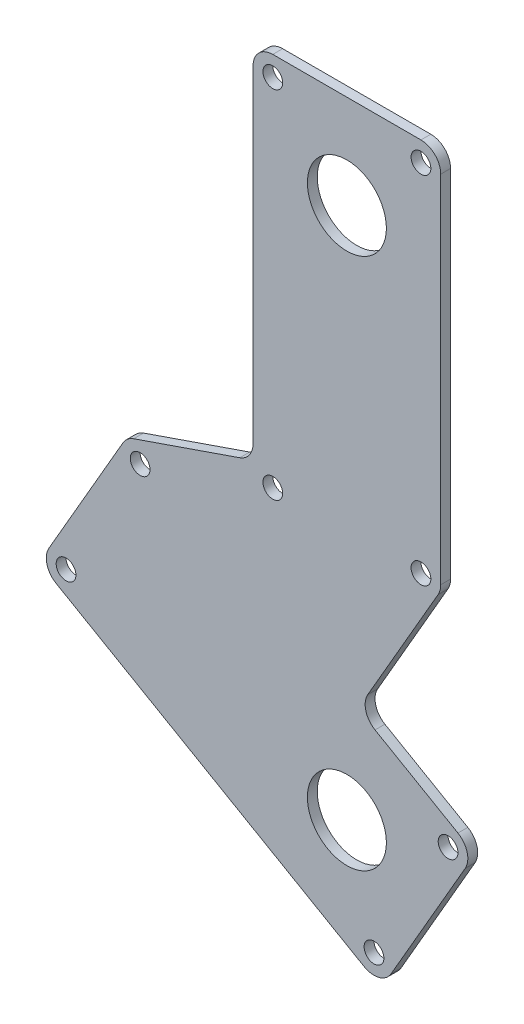
ISO-10303-21;
HEADER;
FILE_DESCRIPTION(('STEP AP214'),'2;1');
FILE_NAME('part.step','',(''),(''),'','','');
FILE_SCHEMA(('AUTOMOTIVE_DESIGN { 1 0 10303 214 1 1 1 1 }'));
ENDSEC;
DATA;
#1=APPLICATION_CONTEXT('core data for automotive mechanical design processes');
#2=APPLICATION_PROTOCOL_DEFINITION('international standard','automotive_design',2000,#1);
#3=PRODUCT_CONTEXT('',#1,'mechanical');
#4=PRODUCT('Part','Part','',(#3));
#5=PRODUCT_RELATED_PRODUCT_CATEGORY('part','',(#4));
#6=PRODUCT_DEFINITION_FORMATION('','',#4);
#7=PRODUCT_DEFINITION_CONTEXT('part definition',#1,'design');
#8=PRODUCT_DEFINITION('design','',#6,#7);
#9=PRODUCT_DEFINITION_SHAPE('','',#8);
#10=(LENGTH_UNIT() NAMED_UNIT(*) SI_UNIT(.MILLI.,.METRE.));
#11=(NAMED_UNIT(*) PLANE_ANGLE_UNIT() SI_UNIT($,.RADIAN.));
#12=(NAMED_UNIT(*) SI_UNIT($,.STERADIAN.) SOLID_ANGLE_UNIT());
#13=UNCERTAINTY_MEASURE_WITH_UNIT(LENGTH_MEASURE(1.E-05),#10,'distance_accuracy_value','');
#14=(GEOMETRIC_REPRESENTATION_CONTEXT(3) GLOBAL_UNCERTAINTY_ASSIGNED_CONTEXT((#13)) GLOBAL_UNIT_ASSIGNED_CONTEXT((#10,
#11,#12)) REPRESENTATION_CONTEXT('',''));
#15=CARTESIAN_POINT('',(0.,0.,0.));
#16=DIRECTION('',(0.,0.,1.));
#17=DIRECTION('',(1.,0.,0.));
#18=AXIS2_PLACEMENT_3D('',#15,#16,#17);
#19=CARTESIAN_POINT('',(-7.63092551338935,4.40571689932132,1.));
#20=DIRECTION('',(-0.866025403784438,0.5,0.));
#21=DIRECTION('',(-0.5,-0.866025403784438,0.));
#22=AXIS2_PLACEMENT_3D('',#19,#20,#21);
#23=PLANE('',#22);
#24=DIRECTION('',(0.5,0.866025403784438,0.));
#25=VECTOR('',#24,1.);
#26=CARTESIAN_POINT('',(-7.63092551338935,4.40571689932132,1.));
#27=LINE('',#26,#25);
#28=CARTESIAN_POINT('',(-30.1637748154254,-34.622322931098,1.));
#29=VERTEX_POINT('',#28);
#30=CARTESIAN_POINT('',(-22.6637748154254,-21.6319418743315,1.));
#31=VERTEX_POINT('',#30);
#32=EDGE_CURVE('E363',#29,#31,#27,.T.);
#33=ORIENTED_EDGE('',*,*,#32,.T.);
#34=DIRECTION('',(0.,0.,-1.));
#35=VECTOR('',#34,1.);
#36=CARTESIAN_POINT('',(-22.6637748154254,-21.6319418743315,0.));
#37=LINE('',#36,#35);
#38=CARTESIAN_POINT('',(-22.6637748154254,-21.6319418743315,0.));
#39=VERTEX_POINT('',#38);
#40=EDGE_CURVE('E229',#31,#39,#37,.T.);
#41=ORIENTED_EDGE('',*,*,#40,.T.);
#42=DIRECTION('',(0.5,0.866025403784438,0.));
#43=VECTOR('',#42,1.);
#44=CARTESIAN_POINT('',(-7.63092551338935,4.40571689932132,0.));
#45=LINE('',#44,#43);
#46=CARTESIAN_POINT('',(-30.1637748154254,-34.622322931098,0.));
#47=VERTEX_POINT('',#46);
#48=EDGE_CURVE('E337',#47,#39,#45,.T.);
#49=ORIENTED_EDGE('',*,*,#48,.F.);
#50=DIRECTION('',(0.,0.,-1.));
#51=VECTOR('',#50,1.);
#52=CARTESIAN_POINT('',(-30.1637748154254,-34.622322931098,1.));
#53=LINE('',#52,#51);
#54=EDGE_CURVE('E227',#47,#29,#53,.F.);
#55=ORIENTED_EDGE('',*,*,#54,.T.);
#56=EDGE_LOOP('',(#33,#41,#49,#55));
#57=FACE_BOUND('',#56,.T.);
#58=ADVANCED_FACE('F34',(#57),#23,.T.);
#59=CARTESIAN_POINT('',(-23.5328493020361,-40.7600906379882,1.));
#60=DIRECTION('',(-0.5,-0.866025403784439,0.));
#61=DIRECTION('',(0.866025403784439,-0.5,0.));
#62=AXIS2_PLACEMENT_3D('',#59,#60,#61);
#63=PLANE('',#62);
#64=DIRECTION('',(-0.866025403784439,0.5,0.));
#65=VECTOR('',#64,1.);
#66=CARTESIAN_POINT('',(-23.5328493020361,-40.7600906379882,1.));
#67=LINE('',#66,#65);
#68=CARTESIAN_POINT('',(1.74519052838324,-55.3543737386669,1.));
#69=VERTEX_POINT('',#68);
#70=CARTESIAN_POINT('',(-29.4317240078565,-37.3543737386669,1.));
#71=VERTEX_POINT('',#70);
#72=EDGE_CURVE('E356',#69,#71,#67,.T.);
#73=ORIENTED_EDGE('',*,*,#72,.T.);
#74=DIRECTION('',(0.,0.,-1.));
#75=VECTOR('',#74,1.);
#76=CARTESIAN_POINT('',(-29.4317240078565,-37.3543737386669,1.));
#77=LINE('',#76,#75);
#78=CARTESIAN_POINT('',(-29.4317240078565,-37.3543737386669,0.));
#79=VERTEX_POINT('',#78);
#80=EDGE_CURVE('E237',#71,#79,#77,.T.);
#81=ORIENTED_EDGE('',*,*,#80,.T.);
#82=DIRECTION('',(-0.866025403784439,0.5,0.));
#83=VECTOR('',#82,1.);
#84=CARTESIAN_POINT('',(-23.5328493020361,-40.7600906379882,0.));
#85=LINE('',#84,#83);
#86=CARTESIAN_POINT('',(1.74519052838324,-55.3543737386669,0.));
#87=VERTEX_POINT('',#86);
#88=EDGE_CURVE('E285',#87,#79,#85,.T.);
#89=ORIENTED_EDGE('',*,*,#88,.F.);
#90=DIRECTION('',(0.,0.,-1.));
#91=VECTOR('',#90,1.);
#92=CARTESIAN_POINT('',(1.74519052838324,-55.3543737386669,1.));
#93=LINE('',#92,#91);
#94=EDGE_CURVE('E235',#87,#69,#93,.F.);
#95=ORIENTED_EDGE('',*,*,#94,.T.);
#96=EDGE_LOOP('',(#73,#81,#89,#95));
#97=FACE_BOUND('',#96,.T.);
#98=ADVANCED_FACE('F345',(#97),#63,.T.);
#99=CARTESIAN_POINT('',(27.0100906379882,-15.5942831006787,1.));
#100=DIRECTION('',(0.866025403784439,-0.5,0.));
#101=DIRECTION('',(0.5,0.866025403784439,0.));
#102=AXIS2_PLACEMENT_3D('',#99,#100,#101);
#103=PLANE('',#102);
#104=DIRECTION('',(-0.5,-0.866025403784439,0.));
#105=VECTOR('',#104,1.);
#106=CARTESIAN_POINT('',(27.0100906379882,-15.5942831006787,1.));
#107=LINE('',#106,#105);
#108=CARTESIAN_POINT('',(11.9772413359521,-41.6319418743314,1.));
#109=VERTEX_POINT('',#108);
#110=CARTESIAN_POINT('',(4.47724133595212,-54.622322931098,1.));
#111=VERTEX_POINT('',#110);
#112=EDGE_CURVE('E354',#109,#111,#107,.T.);
#113=ORIENTED_EDGE('',*,*,#112,.T.);
#114=DIRECTION('',(0.,0.,-1.));
#115=VECTOR('',#114,1.);
#116=CARTESIAN_POINT('',(4.47724133595213,-54.622322931098,1.));
#117=LINE('',#116,#115);
#118=CARTESIAN_POINT('',(4.47724133595212,-54.622322931098,0.));
#119=VERTEX_POINT('',#118);
#120=EDGE_CURVE('E242',#111,#119,#117,.T.);
#121=ORIENTED_EDGE('',*,*,#120,.T.);
#122=DIRECTION('',(-0.5,-0.866025403784439,0.));
#123=VECTOR('',#122,1.);
#124=CARTESIAN_POINT('',(27.0100906379882,-15.5942831006787,0.));
#125=LINE('',#124,#123);
#126=CARTESIAN_POINT('',(11.9772413359521,-41.6319418743314,0.));
#127=VERTEX_POINT('',#126);
#128=EDGE_CURVE('E280',#127,#119,#125,.T.);
#129=ORIENTED_EDGE('',*,*,#128,.F.);
#130=DIRECTION('',(0.,0.,-1.));
#131=VECTOR('',#130,1.);
#132=CARTESIAN_POINT('',(11.9772413359522,-41.6319418743314,1.));
#133=LINE('',#132,#131);
#134=EDGE_CURVE('E240',#127,#109,#133,.F.);
#135=ORIENTED_EDGE('',*,*,#134,.T.);
#136=EDGE_LOOP('',(#113,#121,#129,#135));
#137=FACE_BOUND('',#136,.T.);
#138=ADVANCED_FACE('F358',(#137),#103,.T.);
#139=CARTESIAN_POINT('',(-14.032849302036,-24.3056079660838,1.));
#140=DIRECTION('',(0.5,0.866025403784439,0.));
#141=DIRECTION('',(-0.866025403784439,0.5,0.));
#142=AXIS2_PLACEMENT_3D('',#139,#140,#141);
#143=PLANE('',#142);
#144=DIRECTION('',(0.866025403784439,-0.5,0.));
#145=VECTOR('',#144,1.);
#146=CARTESIAN_POINT('',(-14.032849302036,-24.3056079660838,1.));
#147=LINE('',#146,#145);
#148=CARTESIAN_POINT('',(2.85048094716168,-34.0532032302755,1.));
#149=VERTEX_POINT('',#148);
#150=CARTESIAN_POINT('',(11.2451905283833,-38.8998910667625,1.));
#151=VERTEX_POINT('',#150);
#152=EDGE_CURVE('E261',#149,#151,#147,.T.);
#153=ORIENTED_EDGE('',*,*,#152,.T.);
#154=DIRECTION('',(0.,0.,-1.));
#155=VECTOR('',#154,1.);
#156=CARTESIAN_POINT('',(11.2451905283833,-38.8998910667625,1.));
#157=LINE('',#156,#155);
#158=CARTESIAN_POINT('',(11.2451905283833,-38.8998910667625,0.));
#159=VERTEX_POINT('',#158);
#160=EDGE_CURVE('E247',#151,#159,#157,.T.);
#161=ORIENTED_EDGE('',*,*,#160,.T.);
#162=DIRECTION('',(0.866025403784439,-0.5,0.));
#163=VECTOR('',#162,1.);
#164=CARTESIAN_POINT('',(-14.032849302036,-24.3056079660838,0.));
#165=LINE('',#164,#163);
#166=CARTESIAN_POINT('',(2.85048094716168,-34.0532032302755,0.));
#167=VERTEX_POINT('',#166);
#168=EDGE_CURVE('E275',#167,#159,#165,.T.);
#169=ORIENTED_EDGE('',*,*,#168,.F.);
#170=DIRECTION('',(0.,0.,-1.));
#171=VECTOR('',#170,1.);
#172=CARTESIAN_POINT('',(2.85048094716168,-34.0532032302755,1.));
#173=LINE('',#172,#171);
#174=EDGE_CURVE('E245',#167,#149,#173,.F.);
#175=ORIENTED_EDGE('',*,*,#174,.T.);
#176=EDGE_LOOP('',(#153,#161,#169,#175));
#177=FACE_BOUND('',#176,.T.);
#178=ADVANCED_FACE('F278',(#177),#143,.T.);
#179=CARTESIAN_POINT('',(15.1512794416288,-8.74759526419165,1.));
#180=DIRECTION('',(0.866025403784439,-0.5,0.));
#181=DIRECTION('',(0.5,0.866025403784439,0.));
#182=AXIS2_PLACEMENT_3D('',#179,#180,#181);
#183=PLANE('',#182);
#184=DIRECTION('',(-0.5,-0.866025403784439,0.));
#185=VECTOR('',#184,1.);
#186=CARTESIAN_POINT('',(15.1512794416288,-8.74759526419165,0.));
#187=LINE('',#186,#185);
#188=CARTESIAN_POINT('',(9.23205080756887,-19.,0.));
#189=VERTEX_POINT('',#188);
#190=CARTESIAN_POINT('',(2.1184301395928,-31.3211524227066,0.));
#191=VERTEX_POINT('',#190);
#192=EDGE_CURVE('E276',#189,#191,#187,.T.);
#193=ORIENTED_EDGE('',*,*,#192,.F.);
#194=DIRECTION('',(0.,0.,-1.));
#195=VECTOR('',#194,1.);
#196=CARTESIAN_POINT('',(9.23205080756888,-19.,1.));
#197=LINE('',#196,#195);
#198=CARTESIAN_POINT('',(9.23205080756887,-19.,1.));
#199=VERTEX_POINT('',#198);
#200=EDGE_CURVE('E225',#189,#199,#197,.F.);
#201=ORIENTED_EDGE('',*,*,#200,.T.);
#202=DIRECTION('',(-0.5,-0.866025403784439,0.));
#203=VECTOR('',#202,1.);
#204=CARTESIAN_POINT('',(15.1512794416288,-8.74759526419165,1.));
#205=LINE('',#204,#203);
#206=CARTESIAN_POINT('',(2.1184301395928,-31.3211524227066,1.));
#207=VERTEX_POINT('',#206);
#208=EDGE_CURVE('E258',#199,#207,#205,.T.);
#209=ORIENTED_EDGE('',*,*,#208,.T.);
#210=DIRECTION('',(0.,0.,-1.));
#211=VECTOR('',#210,1.);
#212=CARTESIAN_POINT('',(2.1184301395928,-31.3211524227066,0.));
#213=LINE('',#212,#211);
#214=EDGE_CURVE('E222',#207,#191,#213,.T.);
#215=ORIENTED_EDGE('',*,*,#214,.T.);
#216=EDGE_LOOP('',(#193,#201,#209,#215));
#217=FACE_BOUND('',#216,.T.);
#218=ADVANCED_FACE('F267',(#217),#183,.T.);
#219=CARTESIAN_POINT('',(9.5,0.,1.));
#220=DIRECTION('',(-1.,0.,0.));
#221=DIRECTION('',(0.,0.,1.));
#222=AXIS2_PLACEMENT_3D('',#219,#220,#221);
#223=PLANE('',#222);
#224=DIRECTION('',(0.,1.,0.));
#225=VECTOR('',#224,1.);
#226=CARTESIAN_POINT('',(9.5,0.,0.));
#227=LINE('',#226,#225);
#228=CARTESIAN_POINT('',(9.5,-18.,0.));
#229=VERTEX_POINT('',#228);
#230=CARTESIAN_POINT('',(9.5,18.,0.));
#231=VERTEX_POINT('',#230);
#232=EDGE_CURVE('E282',#229,#231,#227,.T.);
#233=ORIENTED_EDGE('',*,*,#232,.T.);
#234=DIRECTION('',(0.,0.,-1.));
#235=VECTOR('',#234,1.);
#236=CARTESIAN_POINT('',(9.5,18.,1.));
#237=LINE('',#236,#235);
#238=CARTESIAN_POINT('',(9.5,18.,1.));
#239=VERTEX_POINT('',#238);
#240=EDGE_CURVE('E220',#231,#239,#237,.F.);
#241=ORIENTED_EDGE('',*,*,#240,.T.);
#242=DIRECTION('',(0.,1.,0.));
#243=VECTOR('',#242,1.);
#244=CARTESIAN_POINT('',(9.5,0.,1.));
#245=LINE('',#244,#243);
#246=CARTESIAN_POINT('',(9.5,-18.,1.));
#247=VERTEX_POINT('',#246);
#248=EDGE_CURVE('E270',#247,#239,#245,.T.);
#249=ORIENTED_EDGE('',*,*,#248,.F.);
#250=DIRECTION('',(0.,0.,-1.));
#251=VECTOR('',#250,1.);
#252=CARTESIAN_POINT('',(9.5,-18.,0.));
#253=LINE('',#252,#251);
#254=EDGE_CURVE('E217',#247,#229,#253,.T.);
#255=ORIENTED_EDGE('',*,*,#254,.T.);
#256=EDGE_LOOP('',(#233,#241,#249,#255));
#257=FACE_BOUND('',#256,.T.);
#258=ADVANCED_FACE('F374',(#257),#223,.F.);
#259=CARTESIAN_POINT('',(0.,20.,1.));
#260=DIRECTION('',(0.,1.,0.));
#261=DIRECTION('',(-1.,0.,0.));
#262=AXIS2_PLACEMENT_3D('',#259,#260,#261);
#263=PLANE('',#262);
#264=DIRECTION('',(1.,0.,0.));
#265=VECTOR('',#264,1.);
#266=CARTESIAN_POINT('',(0.,20.,0.));
#267=LINE('',#266,#265);
#268=CARTESIAN_POINT('',(-7.5,20.,0.));
#269=VERTEX_POINT('',#268);
#270=CARTESIAN_POINT('',(7.5,20.,0.));
#271=VERTEX_POINT('',#270);
#272=EDGE_CURVE('E175',#269,#271,#267,.T.);
#273=ORIENTED_EDGE('',*,*,#272,.F.);
#274=DIRECTION('',(0.,0.,-1.));
#275=VECTOR('',#274,1.);
#276=CARTESIAN_POINT('',(-7.5,20.,1.));
#277=LINE('',#276,#275);
#278=CARTESIAN_POINT('',(-7.5,20.,1.));
#279=VERTEX_POINT('',#278);
#280=EDGE_CURVE('E201',#269,#279,#277,.F.);
#281=ORIENTED_EDGE('',*,*,#280,.T.);
#282=DIRECTION('',(1.,0.,0.));
#283=VECTOR('',#282,1.);
#284=CARTESIAN_POINT('',(0.,20.,1.));
#285=LINE('',#284,#283);
#286=CARTESIAN_POINT('',(7.5,20.,1.));
#287=VERTEX_POINT('',#286);
#288=EDGE_CURVE('E302',#279,#287,#285,.T.);
#289=ORIENTED_EDGE('',*,*,#288,.T.);
#290=DIRECTION('',(0.,0.,-1.));
#291=VECTOR('',#290,1.);
#292=CARTESIAN_POINT('',(7.5,20.,0.));
#293=LINE('',#292,#291);
#294=EDGE_CURVE('E198',#287,#271,#293,.T.);
#295=ORIENTED_EDGE('',*,*,#294,.T.);
#296=EDGE_LOOP('',(#273,#281,#289,#295));
#297=FACE_BOUND('',#296,.T.);
#298=ADVANCED_FACE('F296',(#297),#263,.T.);
#299=CARTESIAN_POINT('',(-9.5,0.,1.));
#300=DIRECTION('',(-1.,0.,0.));
#301=DIRECTION('',(0.,0.,1.));
#302=AXIS2_PLACEMENT_3D('',#299,#300,#301);
#303=PLANE('',#302);
#304=DIRECTION('',(0.,1.,0.));
#305=VECTOR('',#304,1.);
#306=CARTESIAN_POINT('',(-9.5,0.,1.));
#307=LINE('',#306,#305);
#308=CARTESIAN_POINT('',(-9.5,-15.1482389026027,1.));
#309=VERTEX_POINT('',#308);
#310=CARTESIAN_POINT('',(-9.5,18.,1.));
#311=VERTEX_POINT('',#310);
#312=EDGE_CURVE('E181',#309,#311,#307,.T.);
#313=ORIENTED_EDGE('',*,*,#312,.T.);
#314=DIRECTION('',(0.,0.,-1.));
#315=VECTOR('',#314,1.);
#316=CARTESIAN_POINT('',(-9.5,18.,1.));
#317=LINE('',#316,#315);
#318=CARTESIAN_POINT('',(-9.5,18.,0.));
#319=VERTEX_POINT('',#318);
#320=EDGE_CURVE('E174',#311,#319,#317,.T.);
#321=ORIENTED_EDGE('',*,*,#320,.T.);
#322=DIRECTION('',(0.,1.,0.));
#323=VECTOR('',#322,1.);
#324=CARTESIAN_POINT('',(-9.5,0.,0.));
#325=LINE('',#324,#323);
#326=CARTESIAN_POINT('',(-9.5,-15.1482389026027,0.));
#327=VERTEX_POINT('',#326);
#328=EDGE_CURVE('E161',#327,#319,#325,.T.);
#329=ORIENTED_EDGE('',*,*,#328,.F.);
#330=DIRECTION('',(0.,0.,-1.));
#331=VECTOR('',#330,1.);
#332=CARTESIAN_POINT('',(-9.5,-15.1482389026027,1.));
#333=LINE('',#332,#331);
#334=EDGE_CURVE('E172',#327,#309,#333,.F.);
#335=ORIENTED_EDGE('',*,*,#334,.T.);
#336=EDGE_LOOP('',(#313,#321,#329,#335));
#337=FACE_BOUND('',#336,.T.);
#338=ADVANCED_FACE('F171',(#337),#303,.T.);
#339=CARTESIAN_POINT('',(-7.5,18.,1.));
#340=DIRECTION('',(0.,0.,-1.));
#341=DIRECTION('',(-1.,0.,0.));
#342=AXIS2_PLACEMENT_3D('',#339,#340,#341);
#343=CYLINDRICAL_SURFACE('',#342,1.);
#344=CARTESIAN_POINT('',(-7.5,18.,1.));
#345=DIRECTION('',(0.,0.,1.));
#346=DIRECTION('',(1.,0.,0.));
#347=AXIS2_PLACEMENT_3D('',#344,#345,#346);
#348=CIRCLE('',#347,1.);
#349=CARTESIAN_POINT('',(-6.5,18.,1.));
#350=VERTEX_POINT('',#349);
#351=EDGE_CURVE('E610',#350,#350,#348,.T.);
#352=ORIENTED_EDGE('',*,*,#351,.T.);
#353=EDGE_LOOP('',(#352));
#354=FACE_BOUND('',#353,.T.);
#355=CARTESIAN_POINT('',(-7.5,18.,0.));
#356=DIRECTION('',(0.,0.,1.));
#357=DIRECTION('',(1.,0.,0.));
#358=AXIS2_PLACEMENT_3D('',#355,#356,#357);
#359=CIRCLE('',#358,1.);
#360=CARTESIAN_POINT('',(-6.5,18.,0.));
#361=VERTEX_POINT('',#360);
#362=EDGE_CURVE('E334',#361,#361,#359,.T.);
#363=ORIENTED_EDGE('',*,*,#362,.F.);
#364=EDGE_LOOP('',(#363));
#365=FACE_BOUND('',#364,.T.);
#366=ADVANCED_FACE('F398',(#354,#365),#343,.F.);
#367=CARTESIAN_POINT('',(7.5,18.,1.));
#368=DIRECTION('',(0.,0.,-1.));
#369=DIRECTION('',(-1.,0.,0.));
#370=AXIS2_PLACEMENT_3D('',#367,#368,#369);
#371=CYLINDRICAL_SURFACE('',#370,1.);
#372=CARTESIAN_POINT('',(7.5,18.,1.));
#373=DIRECTION('',(0.,0.,1.));
#374=DIRECTION('',(1.,0.,0.));
#375=AXIS2_PLACEMENT_3D('',#372,#373,#374);
#376=CIRCLE('',#375,1.);
#377=CARTESIAN_POINT('',(8.5,18.,1.));
#378=VERTEX_POINT('',#377);
#379=EDGE_CURVE('E612',#378,#378,#376,.T.);
#380=ORIENTED_EDGE('',*,*,#379,.T.);
#381=EDGE_LOOP('',(#380));
#382=FACE_BOUND('',#381,.T.);
#383=CARTESIAN_POINT('',(7.5,18.,0.));
#384=DIRECTION('',(0.,0.,1.));
#385=DIRECTION('',(1.,0.,0.));
#386=AXIS2_PLACEMENT_3D('',#383,#384,#385);
#387=CIRCLE('',#386,1.);
#388=CARTESIAN_POINT('',(8.5,18.,0.));
#389=VERTEX_POINT('',#388);
#390=EDGE_CURVE('E331',#389,#389,#387,.T.);
#391=ORIENTED_EDGE('',*,*,#390,.F.);
#392=EDGE_LOOP('',(#391));
#393=FACE_BOUND('',#392,.T.);
#394=ADVANCED_FACE('F401',(#382,#393),#371,.F.);
#395=CARTESIAN_POINT('',(7.5,-18.,1.));
#396=DIRECTION('',(0.,0.,-1.));
#397=DIRECTION('',(-1.,0.,0.));
#398=AXIS2_PLACEMENT_3D('',#395,#396,#397);
#399=CYLINDRICAL_SURFACE('',#398,1.);
#400=CARTESIAN_POINT('',(7.5,-18.,1.));
#401=DIRECTION('',(0.,0.,1.));
#402=DIRECTION('',(1.,0.,0.));
#403=AXIS2_PLACEMENT_3D('',#400,#401,#402);
#404=CIRCLE('',#403,1.);
#405=CARTESIAN_POINT('',(8.5,-18.,1.));
#406=VERTEX_POINT('',#405);
#407=EDGE_CURVE('E617',#406,#406,#404,.T.);
#408=ORIENTED_EDGE('',*,*,#407,.T.);
#409=EDGE_LOOP('',(#408));
#410=FACE_BOUND('',#409,.T.);
#411=CARTESIAN_POINT('',(7.5,-18.,0.));
#412=DIRECTION('',(0.,0.,1.));
#413=DIRECTION('',(1.,0.,0.));
#414=AXIS2_PLACEMENT_3D('',#411,#412,#413);
#415=CIRCLE('',#414,1.);
#416=CARTESIAN_POINT('',(8.5,-18.,0.));
#417=VERTEX_POINT('',#416);
#418=EDGE_CURVE('E328',#417,#417,#415,.T.);
#419=ORIENTED_EDGE('',*,*,#418,.F.);
#420=EDGE_LOOP('',(#419));
#421=FACE_BOUND('',#420,.T.);
#422=ADVANCED_FACE('F405',(#410,#421),#399,.F.);
#423=CARTESIAN_POINT('',(-7.5,-18.,1.));
#424=DIRECTION('',(0.,0.,-1.));
#425=DIRECTION('',(-1.,0.,0.));
#426=AXIS2_PLACEMENT_3D('',#423,#424,#425);
#427=CYLINDRICAL_SURFACE('',#426,1.);
#428=CARTESIAN_POINT('',(-7.5,-18.,1.));
#429=DIRECTION('',(0.,0.,1.));
#430=DIRECTION('',(1.,0.,0.));
#431=AXIS2_PLACEMENT_3D('',#428,#429,#430);
#432=CIRCLE('',#431,1.);
#433=CARTESIAN_POINT('',(-6.5,-18.,1.));
#434=VERTEX_POINT('',#433);
#435=EDGE_CURVE('E620',#434,#434,#432,.T.);
#436=ORIENTED_EDGE('',*,*,#435,.T.);
#437=EDGE_LOOP('',(#436));
#438=FACE_BOUND('',#437,.T.);
#439=CARTESIAN_POINT('',(-7.5,-18.,0.));
#440=DIRECTION('',(0.,0.,1.));
#441=DIRECTION('',(1.,0.,0.));
#442=AXIS2_PLACEMENT_3D('',#439,#440,#441);
#443=CIRCLE('',#442,1.);
#444=CARTESIAN_POINT('',(-6.5,-18.,0.));
#445=VERTEX_POINT('',#444);
#446=EDGE_CURVE('E325',#445,#445,#443,.T.);
#447=ORIENTED_EDGE('',*,*,#446,.F.);
#448=EDGE_LOOP('',(#447));
#449=FACE_BOUND('',#448,.T.);
#450=ADVANCED_FACE('F409',(#438,#449),#427,.F.);
#451=CARTESIAN_POINT('',(-20.9317240078565,-22.6319418743315,1.));
#452=DIRECTION('',(0.,0.,-1.));
#453=DIRECTION('',(-1.,0.,0.));
#454=AXIS2_PLACEMENT_3D('',#451,#452,#453);
#455=CYLINDRICAL_SURFACE('',#454,0.999999999999994);
#456=CARTESIAN_POINT('',(-20.9317240078565,-22.6319418743315,1.));
#457=DIRECTION('',(0.,0.,1.));
#458=DIRECTION('',(1.,0.,0.));
#459=AXIS2_PLACEMENT_3D('',#456,#457,#458);
#460=CIRCLE('',#459,0.999999999999994);
#461=CARTESIAN_POINT('',(-19.9317240078565,-22.6319418743315,1.));
#462=VERTEX_POINT('',#461);
#463=EDGE_CURVE('E623',#462,#462,#460,.T.);
#464=ORIENTED_EDGE('',*,*,#463,.T.);
#465=EDGE_LOOP('',(#464));
#466=FACE_BOUND('',#465,.T.);
#467=CARTESIAN_POINT('',(-20.9317240078565,-22.6319418743315,0.));
#468=DIRECTION('',(0.,0.,1.));
#469=DIRECTION('',(1.,0.,0.));
#470=AXIS2_PLACEMENT_3D('',#467,#468,#469);
#471=CIRCLE('',#470,0.999999999999994);
#472=CARTESIAN_POINT('',(-19.9317240078565,-22.6319418743315,0.));
#473=VERTEX_POINT('',#472);
#474=EDGE_CURVE('E322',#473,#473,#471,.T.);
#475=ORIENTED_EDGE('',*,*,#474,.F.);
#476=EDGE_LOOP('',(#475));
#477=FACE_BOUND('',#476,.T.);
#478=ADVANCED_FACE('F413',(#466,#477),#455,.F.);
#479=CARTESIAN_POINT('',(10.2451905283832,-40.6319418743314,1.));
#480=DIRECTION('',(0.,0.,-1.));
#481=DIRECTION('',(-1.,0.,0.));
#482=AXIS2_PLACEMENT_3D('',#479,#480,#481);
#483=CYLINDRICAL_SURFACE('',#482,1.);
#484=CARTESIAN_POINT('',(10.2451905283832,-40.6319418743314,1.));
#485=DIRECTION('',(0.,0.,1.));
#486=DIRECTION('',(1.,0.,0.));
#487=AXIS2_PLACEMENT_3D('',#484,#485,#486);
#488=CIRCLE('',#487,1.);
#489=CARTESIAN_POINT('',(11.2451905283832,-40.6319418743314,1.));
#490=VERTEX_POINT('',#489);
#491=EDGE_CURVE('E626',#490,#490,#488,.T.);
#492=ORIENTED_EDGE('',*,*,#491,.T.);
#493=EDGE_LOOP('',(#492));
#494=FACE_BOUND('',#493,.T.);
#495=CARTESIAN_POINT('',(10.2451905283832,-40.6319418743314,0.));
#496=DIRECTION('',(0.,0.,1.));
#497=DIRECTION('',(1.,0.,0.));
#498=AXIS2_PLACEMENT_3D('',#495,#496,#497);
#499=CIRCLE('',#498,1.);
#500=CARTESIAN_POINT('',(11.2451905283832,-40.6319418743314,0.));
#501=VERTEX_POINT('',#500);
#502=EDGE_CURVE('E319',#501,#501,#499,.T.);
#503=ORIENTED_EDGE('',*,*,#502,.F.);
#504=EDGE_LOOP('',(#503));
#505=FACE_BOUND('',#504,.T.);
#506=ADVANCED_FACE('F417',(#494,#505),#483,.F.);
#507=CARTESIAN_POINT('',(-28.4317240078565,-35.622322931098,1.));
#508=DIRECTION('',(0.,0.,-1.));
#509=DIRECTION('',(-1.,0.,0.));
#510=AXIS2_PLACEMENT_3D('',#507,#508,#509);
#511=CYLINDRICAL_SURFACE('',#510,1.);
#512=CARTESIAN_POINT('',(-28.4317240078565,-35.622322931098,1.));
#513=DIRECTION('',(0.,0.,1.));
#514=DIRECTION('',(1.,0.,0.));
#515=AXIS2_PLACEMENT_3D('',#512,#513,#514);
#516=CIRCLE('',#515,1.);
#517=CARTESIAN_POINT('',(-27.4317240078565,-35.622322931098,1.));
#518=VERTEX_POINT('',#517);
#519=EDGE_CURVE('E629',#518,#518,#516,.T.);
#520=ORIENTED_EDGE('',*,*,#519,.T.);
#521=EDGE_LOOP('',(#520));
#522=FACE_BOUND('',#521,.T.);
#523=CARTESIAN_POINT('',(-28.4317240078565,-35.622322931098,0.));
#524=DIRECTION('',(0.,0.,1.));
#525=DIRECTION('',(1.,0.,0.));
#526=AXIS2_PLACEMENT_3D('',#523,#524,#525);
#527=CIRCLE('',#526,1.);
#528=CARTESIAN_POINT('',(-27.4317240078565,-35.622322931098,0.));
#529=VERTEX_POINT('',#528);
#530=EDGE_CURVE('E316',#529,#529,#527,.T.);
#531=ORIENTED_EDGE('',*,*,#530,.F.);
#532=EDGE_LOOP('',(#531));
#533=FACE_BOUND('',#532,.T.);
#534=ADVANCED_FACE('F421',(#522,#533),#511,.F.);
#535=CARTESIAN_POINT('',(2.74519052838326,-53.622322931098,1.));
#536=DIRECTION('',(0.,0.,-1.));
#537=DIRECTION('',(-1.,0.,0.));
#538=AXIS2_PLACEMENT_3D('',#535,#536,#537);
#539=CYLINDRICAL_SURFACE('',#538,1.);
#540=CARTESIAN_POINT('',(2.74519052838326,-53.622322931098,1.));
#541=DIRECTION('',(0.,0.,1.));
#542=DIRECTION('',(1.,0.,0.));
#543=AXIS2_PLACEMENT_3D('',#540,#541,#542);
#544=CIRCLE('',#543,1.);
#545=CARTESIAN_POINT('',(3.74519052838326,-53.622322931098,1.));
#546=VERTEX_POINT('',#545);
#547=EDGE_CURVE('E632',#546,#546,#544,.T.);
#548=ORIENTED_EDGE('',*,*,#547,.T.);
#549=EDGE_LOOP('',(#548));
#550=FACE_BOUND('',#549,.T.);
#551=CARTESIAN_POINT('',(2.74519052838326,-53.622322931098,0.));
#552=DIRECTION('',(0.,0.,1.));
#553=DIRECTION('',(1.,0.,0.));
#554=AXIS2_PLACEMENT_3D('',#551,#552,#553);
#555=CIRCLE('',#554,1.);
#556=CARTESIAN_POINT('',(3.74519052838326,-53.622322931098,0.));
#557=VERTEX_POINT('',#556);
#558=EDGE_CURVE('E313',#557,#557,#555,.T.);
#559=ORIENTED_EDGE('',*,*,#558,.F.);
#560=EDGE_LOOP('',(#559));
#561=FACE_BOUND('',#560,.T.);
#562=ADVANCED_FACE('F425',(#550,#561),#539,.F.);
#563=CARTESIAN_POINT('',(0.,10.5,1.));
#564=DIRECTION('',(0.,0.,-1.));
#565=DIRECTION('',(-1.,0.,0.));
#566=AXIS2_PLACEMENT_3D('',#563,#564,#565);
#567=CYLINDRICAL_SURFACE('',#566,4.);
#568=CARTESIAN_POINT('',(0.,10.5,1.));
#569=DIRECTION('',(0.,0.,1.));
#570=DIRECTION('',(1.,0.,0.));
#571=AXIS2_PLACEMENT_3D('',#568,#569,#570);
#572=CIRCLE('',#571,4.);
#573=CARTESIAN_POINT('',(4.,10.5,1.));
#574=VERTEX_POINT('',#573);
#575=EDGE_CURVE('E635',#574,#574,#572,.T.);
#576=ORIENTED_EDGE('',*,*,#575,.T.);
#577=EDGE_LOOP('',(#576));
#578=FACE_BOUND('',#577,.T.);
#579=CARTESIAN_POINT('',(0.,10.5,0.));
#580=DIRECTION('',(0.,0.,1.));
#581=DIRECTION('',(1.,0.,0.));
#582=AXIS2_PLACEMENT_3D('',#579,#580,#581);
#583=CIRCLE('',#582,4.);
#584=CARTESIAN_POINT('',(4.,10.5,0.));
#585=VERTEX_POINT('',#584);
#586=EDGE_CURVE('E310',#585,#585,#583,.T.);
#587=ORIENTED_EDGE('',*,*,#586,.F.);
#588=EDGE_LOOP('',(#587));
#589=FACE_BOUND('',#588,.T.);
#590=ADVANCED_FACE('F429',(#578,#589),#567,.F.);
#591=CARTESIAN_POINT('',(0.,-43.3771324027147,1.));
#592=DIRECTION('',(0.,0.,-1.));
#593=DIRECTION('',(-1.,0.,0.));
#594=AXIS2_PLACEMENT_3D('',#591,#592,#593);
#595=CYLINDRICAL_SURFACE('',#594,4.);
#596=CARTESIAN_POINT('',(0.,-43.3771324027147,1.));
#597=DIRECTION('',(0.,0.,1.));
#598=DIRECTION('',(1.,0.,0.));
#599=AXIS2_PLACEMENT_3D('',#596,#597,#598);
#600=CIRCLE('',#599,4.);
#601=CARTESIAN_POINT('',(4.00000000000001,-43.3771324027147,1.));
#602=VERTEX_POINT('',#601);
#603=EDGE_CURVE('E638',#602,#602,#600,.T.);
#604=ORIENTED_EDGE('',*,*,#603,.T.);
#605=EDGE_LOOP('',(#604));
#606=FACE_BOUND('',#605,.T.);
#607=CARTESIAN_POINT('',(0.,-43.3771324027147,0.));
#608=DIRECTION('',(0.,0.,1.));
#609=DIRECTION('',(1.,0.,0.));
#610=AXIS2_PLACEMENT_3D('',#607,#608,#609);
#611=CIRCLE('',#610,4.);
#612=CARTESIAN_POINT('',(4.00000000000001,-43.3771324027147,0.));
#613=VERTEX_POINT('',#612);
#614=EDGE_CURVE('E307',#613,#613,#611,.T.);
#615=ORIENTED_EDGE('',*,*,#614,.F.);
#616=EDGE_LOOP('',(#615));
#617=FACE_BOUND('',#616,.T.);
#618=ADVANCED_FACE('F433',(#606,#617),#595,.F.);
#619=CARTESIAN_POINT('',(4.09844380046313,-11.8846841093999,1.));
#620=DIRECTION('',(0.326010366132058,-0.94536619422023,0.));
#621=DIRECTION('',(0.94536619422023,0.326010366132058,0.));
#622=AXIS2_PLACEMENT_3D('',#619,#620,#621);
#623=PLANE('',#622);
#624=DIRECTION('',(-0.94536619422023,-0.326010366132058,0.));
#625=VECTOR('',#624,1.);
#626=CARTESIAN_POINT('',(4.09844380046313,-11.8846841093999,0.));
#627=LINE('',#626,#625);
#628=CARTESIAN_POINT('',(-10.8479792677359,-17.0389712910432,0.));
#629=VERTEX_POINT('',#628);
#630=CARTESIAN_POINT('',(-21.5837447401207,-20.741209485891,0.));
#631=VERTEX_POINT('',#630);
#632=EDGE_CURVE('E162',#629,#631,#627,.T.);
#633=ORIENTED_EDGE('',*,*,#632,.T.);
#634=DIRECTION('',(0.,0.,-1.));
#635=VECTOR('',#634,1.);
#636=CARTESIAN_POINT('',(-21.5837447401207,-20.741209485891,1.));
#637=LINE('',#636,#635);
#638=CARTESIAN_POINT('',(-21.5837447401207,-20.741209485891,1.));
#639=VERTEX_POINT('',#638);
#640=EDGE_CURVE('E49',#631,#639,#637,.F.);
#641=ORIENTED_EDGE('',*,*,#640,.T.);
#642=DIRECTION('',(-0.94536619422023,-0.326010366132058,0.));
#643=VECTOR('',#642,1.);
#644=CARTESIAN_POINT('',(4.09844380046313,-11.8846841093999,1.));
#645=LINE('',#644,#643);
#646=CARTESIAN_POINT('',(-10.8479792677359,-17.0389712910432,1.));
#647=VERTEX_POINT('',#646);
#648=EDGE_CURVE('E177',#647,#639,#645,.T.);
#649=ORIENTED_EDGE('',*,*,#648,.F.);
#650=DIRECTION('',(0.,0.,-1.));
#651=VECTOR('',#650,1.);
#652=CARTESIAN_POINT('',(-10.8479792677359,-17.0389712910432,1.));
#653=LINE('',#652,#651);
#654=EDGE_CURVE('E232',#647,#629,#653,.T.);
#655=ORIENTED_EDGE('',*,*,#654,.T.);
#656=EDGE_LOOP('',(#633,#641,#649,#655));
#657=FACE_BOUND('',#656,.T.);
#658=ADVANCED_FACE('F437',(#657),#623,.F.);
#659=CARTESIAN_POINT('',(0.,0.,1.));
#660=DIRECTION('',(0.,0.,1.));
#661=DIRECTION('',(1.,0.,0.));
#662=AXIS2_PLACEMENT_3D('',#659,#660,#661);
#663=PLANE('',#662);
#664=ORIENTED_EDGE('',*,*,#603,.F.);
#665=EDGE_LOOP('',(#664));
#666=FACE_BOUND('',#665,.T.);
#667=ORIENTED_EDGE('',*,*,#575,.F.);
#668=EDGE_LOOP('',(#667));
#669=FACE_BOUND('',#668,.T.);
#670=ORIENTED_EDGE('',*,*,#547,.F.);
#671=EDGE_LOOP('',(#670));
#672=FACE_BOUND('',#671,.T.);
#673=ORIENTED_EDGE('',*,*,#519,.F.);
#674=EDGE_LOOP('',(#673));
#675=FACE_BOUND('',#674,.T.);
#676=ORIENTED_EDGE('',*,*,#491,.F.);
#677=EDGE_LOOP('',(#676));
#678=FACE_BOUND('',#677,.T.);
#679=ORIENTED_EDGE('',*,*,#463,.F.);
#680=EDGE_LOOP('',(#679));
#681=FACE_BOUND('',#680,.T.);
#682=ORIENTED_EDGE('',*,*,#435,.F.);
#683=EDGE_LOOP('',(#682));
#684=FACE_BOUND('',#683,.T.);
#685=ORIENTED_EDGE('',*,*,#407,.F.);
#686=EDGE_LOOP('',(#685));
#687=FACE_BOUND('',#686,.T.);
#688=ORIENTED_EDGE('',*,*,#379,.F.);
#689=EDGE_LOOP('',(#688));
#690=FACE_BOUND('',#689,.T.);
#691=ORIENTED_EDGE('',*,*,#351,.F.);
#692=EDGE_LOOP('',(#691));
#693=FACE_BOUND('',#692,.T.);
#694=ORIENTED_EDGE('',*,*,#288,.F.);
#695=CARTESIAN_POINT('',(-7.5,18.,1.));
#696=DIRECTION('',(0.,0.,1.));
#697=DIRECTION('',(1.,0.,0.));
#698=AXIS2_PLACEMENT_3D('',#695,#696,#697);
#699=CIRCLE('',#698,2.);
#700=EDGE_CURVE('E215',#279,#311,#699,.T.);
#701=ORIENTED_EDGE('',*,*,#700,.T.);
#702=ORIENTED_EDGE('',*,*,#312,.F.);
#703=CARTESIAN_POINT('',(-11.5,-15.1482389026027,1.));
#704=DIRECTION('',(0.,0.,1.));
#705=DIRECTION('',(1.,0.,0.));
#706=AXIS2_PLACEMENT_3D('',#703,#704,#705);
#707=CIRCLE('',#706,2.);
#708=EDGE_CURVE('E11',#309,#647,#707,.F.);
#709=ORIENTED_EDGE('',*,*,#708,.T.);
#710=ORIENTED_EDGE('',*,*,#648,.T.);
#711=CARTESIAN_POINT('',(-20.9317240078566,-22.6319418743315,1.));
#712=DIRECTION('',(0.,0.,1.));
#713=DIRECTION('',(1.,0.,0.));
#714=AXIS2_PLACEMENT_3D('',#711,#712,#713);
#715=CIRCLE('',#714,2.);
#716=EDGE_CURVE('E209',#639,#31,#715,.T.);
#717=ORIENTED_EDGE('',*,*,#716,.T.);
#718=ORIENTED_EDGE('',*,*,#32,.F.);
#719=CARTESIAN_POINT('',(-28.4317240078565,-35.622322931098,1.));
#720=DIRECTION('',(0.,0.,1.));
#721=DIRECTION('',(1.,0.,0.));
#722=AXIS2_PLACEMENT_3D('',#719,#720,#721);
#723=CIRCLE('',#722,2.);
#724=EDGE_CURVE('E207',#29,#71,#723,.T.);
#725=ORIENTED_EDGE('',*,*,#724,.T.);
#726=ORIENTED_EDGE('',*,*,#72,.F.);
#727=CARTESIAN_POINT('',(2.74519052838325,-53.622322931098,1.));
#728=DIRECTION('',(0.,0.,1.));
#729=DIRECTION('',(1.,0.,0.));
#730=AXIS2_PLACEMENT_3D('',#727,#728,#729);
#731=CIRCLE('',#730,2.);
#732=EDGE_CURVE('E205',#69,#111,#731,.T.);
#733=ORIENTED_EDGE('',*,*,#732,.T.);
#734=ORIENTED_EDGE('',*,*,#112,.F.);
#735=CARTESIAN_POINT('',(10.2451905283833,-40.6319418743314,1.));
#736=DIRECTION('',(0.,0.,1.));
#737=DIRECTION('',(1.,0.,0.));
#738=AXIS2_PLACEMENT_3D('',#735,#736,#737);
#739=CIRCLE('',#738,2.);
#740=EDGE_CURVE('E203',#109,#151,#739,.T.);
#741=ORIENTED_EDGE('',*,*,#740,.T.);
#742=ORIENTED_EDGE('',*,*,#152,.F.);
#743=CARTESIAN_POINT('',(3.85048094716168,-32.3211524227066,1.));
#744=DIRECTION('',(0.,0.,1.));
#745=DIRECTION('',(1.,0.,0.));
#746=AXIS2_PLACEMENT_3D('',#743,#744,#745);
#747=CIRCLE('',#746,2.);
#748=EDGE_CURVE('E167',#149,#207,#747,.F.);
#749=ORIENTED_EDGE('',*,*,#748,.T.);
#750=ORIENTED_EDGE('',*,*,#208,.F.);
#751=CARTESIAN_POINT('',(7.5,-18.,1.));
#752=DIRECTION('',(0.,0.,1.));
#753=DIRECTION('',(1.,0.,0.));
#754=AXIS2_PLACEMENT_3D('',#751,#752,#753);
#755=CIRCLE('',#754,2.);
#756=EDGE_CURVE('E211',#199,#247,#755,.T.);
#757=ORIENTED_EDGE('',*,*,#756,.T.);
#758=ORIENTED_EDGE('',*,*,#248,.T.);
#759=CARTESIAN_POINT('',(7.5,18.,1.));
#760=DIRECTION('',(0.,0.,1.));
#761=DIRECTION('',(1.,0.,0.));
#762=AXIS2_PLACEMENT_3D('',#759,#760,#761);
#763=CIRCLE('',#762,2.);
#764=EDGE_CURVE('E213',#239,#287,#763,.T.);
#765=ORIENTED_EDGE('',*,*,#764,.T.);
#766=EDGE_LOOP('',(#694,#701,#702,#709,#710,#717,#718,#725,#726,#733,#734,#741,#742,#749,#750,
#757,#758,#765));
#767=FACE_BOUND('',#766,.T.);
#768=ADVANCED_FACE('F257',(#666,#669,#672,#675,#678,#681,#684,#687,#690,#693,#767),#663,.T.);
#769=CARTESIAN_POINT('',(0.,0.,0.));
#770=DIRECTION('',(0.,0.,1.));
#771=DIRECTION('',(1.,0.,0.));
#772=AXIS2_PLACEMENT_3D('',#769,#770,#771);
#773=PLANE('',#772);
#774=ORIENTED_EDGE('',*,*,#614,.T.);
#775=EDGE_LOOP('',(#774));
#776=FACE_BOUND('',#775,.T.);
#777=ORIENTED_EDGE('',*,*,#586,.T.);
#778=EDGE_LOOP('',(#777));
#779=FACE_BOUND('',#778,.T.);
#780=ORIENTED_EDGE('',*,*,#558,.T.);
#781=EDGE_LOOP('',(#780));
#782=FACE_BOUND('',#781,.T.);
#783=ORIENTED_EDGE('',*,*,#530,.T.);
#784=EDGE_LOOP('',(#783));
#785=FACE_BOUND('',#784,.T.);
#786=ORIENTED_EDGE('',*,*,#502,.T.);
#787=EDGE_LOOP('',(#786));
#788=FACE_BOUND('',#787,.T.);
#789=ORIENTED_EDGE('',*,*,#474,.T.);
#790=EDGE_LOOP('',(#789));
#791=FACE_BOUND('',#790,.T.);
#792=ORIENTED_EDGE('',*,*,#446,.T.);
#793=EDGE_LOOP('',(#792));
#794=FACE_BOUND('',#793,.T.);
#795=ORIENTED_EDGE('',*,*,#418,.T.);
#796=EDGE_LOOP('',(#795));
#797=FACE_BOUND('',#796,.T.);
#798=ORIENTED_EDGE('',*,*,#390,.T.);
#799=EDGE_LOOP('',(#798));
#800=FACE_BOUND('',#799,.T.);
#801=ORIENTED_EDGE('',*,*,#362,.T.);
#802=EDGE_LOOP('',(#801));
#803=FACE_BOUND('',#802,.T.);
#804=ORIENTED_EDGE('',*,*,#328,.T.);
#805=CARTESIAN_POINT('',(-7.5,18.,0.));
#806=DIRECTION('',(0.,0.,1.));
#807=DIRECTION('',(1.,0.,0.));
#808=AXIS2_PLACEMENT_3D('',#805,#806,#807);
#809=CIRCLE('',#808,2.);
#810=EDGE_CURVE('E196',#319,#269,#809,.F.);
#811=ORIENTED_EDGE('',*,*,#810,.T.);
#812=ORIENTED_EDGE('',*,*,#272,.T.);
#813=CARTESIAN_POINT('',(7.5,18.,0.));
#814=DIRECTION('',(0.,0.,1.));
#815=DIRECTION('',(1.,0.,0.));
#816=AXIS2_PLACEMENT_3D('',#813,#814,#815);
#817=CIRCLE('',#816,2.);
#818=EDGE_CURVE('E194',#271,#231,#817,.F.);
#819=ORIENTED_EDGE('',*,*,#818,.T.);
#820=ORIENTED_EDGE('',*,*,#232,.F.);
#821=CARTESIAN_POINT('',(7.5,-18.,0.));
#822=DIRECTION('',(0.,0.,1.));
#823=DIRECTION('',(1.,0.,0.));
#824=AXIS2_PLACEMENT_3D('',#821,#822,#823);
#825=CIRCLE('',#824,2.);
#826=EDGE_CURVE('E192',#229,#189,#825,.F.);
#827=ORIENTED_EDGE('',*,*,#826,.T.);
#828=ORIENTED_EDGE('',*,*,#192,.T.);
#829=CARTESIAN_POINT('',(3.85048094716168,-32.3211524227066,0.));
#830=DIRECTION('',(0.,0.,1.));
#831=DIRECTION('',(1.,0.,0.));
#832=AXIS2_PLACEMENT_3D('',#829,#830,#831);
#833=CIRCLE('',#832,2.);
#834=EDGE_CURVE('E250',#191,#167,#833,.T.);
#835=ORIENTED_EDGE('',*,*,#834,.T.);
#836=ORIENTED_EDGE('',*,*,#168,.T.);
#837=CARTESIAN_POINT('',(10.2451905283833,-40.6319418743314,0.));
#838=DIRECTION('',(0.,0.,1.));
#839=DIRECTION('',(1.,0.,0.));
#840=AXIS2_PLACEMENT_3D('',#837,#838,#839);
#841=CIRCLE('',#840,2.);
#842=EDGE_CURVE('E179',#159,#127,#841,.F.);
#843=ORIENTED_EDGE('',*,*,#842,.T.);
#844=ORIENTED_EDGE('',*,*,#128,.T.);
#845=CARTESIAN_POINT('',(2.74519052838325,-53.622322931098,0.));
#846=DIRECTION('',(0.,0.,1.));
#847=DIRECTION('',(1.,0.,0.));
#848=AXIS2_PLACEMENT_3D('',#845,#846,#847);
#849=CIRCLE('',#848,2.);
#850=EDGE_CURVE('E186',#119,#87,#849,.F.);
#851=ORIENTED_EDGE('',*,*,#850,.T.);
#852=ORIENTED_EDGE('',*,*,#88,.T.);
#853=CARTESIAN_POINT('',(-28.4317240078565,-35.622322931098,0.));
#854=DIRECTION('',(0.,0.,1.));
#855=DIRECTION('',(1.,0.,0.));
#856=AXIS2_PLACEMENT_3D('',#853,#854,#855);
#857=CIRCLE('',#856,2.);
#858=EDGE_CURVE('E188',#79,#47,#857,.F.);
#859=ORIENTED_EDGE('',*,*,#858,.T.);
#860=ORIENTED_EDGE('',*,*,#48,.T.);
#861=CARTESIAN_POINT('',(-20.9317240078566,-22.6319418743315,0.));
#862=DIRECTION('',(0.,0.,1.));
#863=DIRECTION('',(1.,0.,0.));
#864=AXIS2_PLACEMENT_3D('',#861,#862,#863);
#865=CIRCLE('',#864,2.);
#866=EDGE_CURVE('E190',#39,#631,#865,.F.);
#867=ORIENTED_EDGE('',*,*,#866,.T.);
#868=ORIENTED_EDGE('',*,*,#632,.F.);
#869=CARTESIAN_POINT('',(-11.5,-15.1482389026027,0.));
#870=DIRECTION('',(0.,0.,1.));
#871=DIRECTION('',(1.,0.,0.));
#872=AXIS2_PLACEMENT_3D('',#869,#870,#871);
#873=CIRCLE('',#872,2.);
#874=EDGE_CURVE('E42',#629,#327,#873,.T.);
#875=ORIENTED_EDGE('',*,*,#874,.T.);
#876=EDGE_LOOP('',(#804,#811,#812,#819,#820,#827,#828,#835,#836,#843,#844,#851,#852,#859,#860,
#867,#868,#875));
#877=FACE_BOUND('',#876,.T.);
#878=ADVANCED_FACE('F160',(#776,#779,#782,#785,#788,#791,#794,#797,#800,#803,#877),#773,.F.);
#879=CARTESIAN_POINT('',(-7.5,18.,1.));
#880=DIRECTION('',(0.,0.,-1.));
#881=DIRECTION('',(-1.,0.,0.));
#882=AXIS2_PLACEMENT_3D('',#879,#880,#881);
#883=CYLINDRICAL_SURFACE('',#882,2.);
#884=ORIENTED_EDGE('',*,*,#700,.F.);
#885=ORIENTED_EDGE('',*,*,#280,.F.);
#886=ORIENTED_EDGE('',*,*,#810,.F.);
#887=ORIENTED_EDGE('',*,*,#320,.F.);
#888=EDGE_LOOP('',(#884,#885,#886,#887));
#889=FACE_BOUND('',#888,.T.);
#890=ADVANCED_FACE('F301',(#889),#883,.T.);
#891=CARTESIAN_POINT('',(7.5,18.,1.));
#892=DIRECTION('',(0.,0.,1.));
#893=DIRECTION('',(1.,0.,0.));
#894=AXIS2_PLACEMENT_3D('',#891,#892,#893);
#895=CYLINDRICAL_SURFACE('',#894,2.);
#896=ORIENTED_EDGE('',*,*,#764,.F.);
#897=ORIENTED_EDGE('',*,*,#240,.F.);
#898=ORIENTED_EDGE('',*,*,#818,.F.);
#899=ORIENTED_EDGE('',*,*,#294,.F.);
#900=EDGE_LOOP('',(#896,#897,#898,#899));
#901=FACE_BOUND('',#900,.T.);
#902=ADVANCED_FACE('F373',(#901),#895,.T.);
#903=CARTESIAN_POINT('',(7.5,-18.,1.));
#904=DIRECTION('',(0.,0.,1.));
#905=DIRECTION('',(1.,0.,0.));
#906=AXIS2_PLACEMENT_3D('',#903,#904,#905);
#907=CYLINDRICAL_SURFACE('',#906,2.);
#908=ORIENTED_EDGE('',*,*,#756,.F.);
#909=ORIENTED_EDGE('',*,*,#200,.F.);
#910=ORIENTED_EDGE('',*,*,#826,.F.);
#911=ORIENTED_EDGE('',*,*,#254,.F.);
#912=EDGE_LOOP('',(#908,#909,#910,#911));
#913=FACE_BOUND('',#912,.T.);
#914=ADVANCED_FACE('F376',(#913),#907,.T.);
#915=CARTESIAN_POINT('',(-20.9317240078566,-22.6319418743315,1.));
#916=DIRECTION('',(0.,0.,1.));
#917=DIRECTION('',(1.,0.,0.));
#918=AXIS2_PLACEMENT_3D('',#915,#916,#917);
#919=CYLINDRICAL_SURFACE('',#918,2.);
#920=ORIENTED_EDGE('',*,*,#716,.F.);
#921=ORIENTED_EDGE('',*,*,#640,.F.);
#922=ORIENTED_EDGE('',*,*,#866,.F.);
#923=ORIENTED_EDGE('',*,*,#40,.F.);
#924=EDGE_LOOP('',(#920,#921,#922,#923));
#925=FACE_BOUND('',#924,.T.);
#926=ADVANCED_FACE('F378',(#925),#919,.T.);
#927=CARTESIAN_POINT('',(-28.4317240078565,-35.622322931098,1.));
#928=DIRECTION('',(0.,0.,-1.));
#929=DIRECTION('',(-1.,0.,0.));
#930=AXIS2_PLACEMENT_3D('',#927,#928,#929);
#931=CYLINDRICAL_SURFACE('',#930,2.);
#932=ORIENTED_EDGE('',*,*,#724,.F.);
#933=ORIENTED_EDGE('',*,*,#54,.F.);
#934=ORIENTED_EDGE('',*,*,#858,.F.);
#935=ORIENTED_EDGE('',*,*,#80,.F.);
#936=EDGE_LOOP('',(#932,#933,#934,#935));
#937=FACE_BOUND('',#936,.T.);
#938=ADVANCED_FACE('F384',(#937),#931,.T.);
#939=CARTESIAN_POINT('',(2.74519052838325,-53.622322931098,1.));
#940=DIRECTION('',(0.,0.,-1.));
#941=DIRECTION('',(-1.,0.,0.));
#942=AXIS2_PLACEMENT_3D('',#939,#940,#941);
#943=CYLINDRICAL_SURFACE('',#942,2.);
#944=ORIENTED_EDGE('',*,*,#732,.F.);
#945=ORIENTED_EDGE('',*,*,#94,.F.);
#946=ORIENTED_EDGE('',*,*,#850,.F.);
#947=ORIENTED_EDGE('',*,*,#120,.F.);
#948=EDGE_LOOP('',(#944,#945,#946,#947));
#949=FACE_BOUND('',#948,.T.);
#950=ADVANCED_FACE('F350',(#949),#943,.T.);
#951=CARTESIAN_POINT('',(10.2451905283833,-40.6319418743314,1.));
#952=DIRECTION('',(0.,0.,-1.));
#953=DIRECTION('',(-1.,0.,0.));
#954=AXIS2_PLACEMENT_3D('',#951,#952,#953);
#955=CYLINDRICAL_SURFACE('',#954,2.);
#956=ORIENTED_EDGE('',*,*,#740,.F.);
#957=ORIENTED_EDGE('',*,*,#134,.F.);
#958=ORIENTED_EDGE('',*,*,#842,.F.);
#959=ORIENTED_EDGE('',*,*,#160,.F.);
#960=EDGE_LOOP('',(#956,#957,#958,#959));
#961=FACE_BOUND('',#960,.T.);
#962=ADVANCED_FACE('F578',(#961),#955,.T.);
#963=CARTESIAN_POINT('',(3.85048094716168,-32.3211524227066,1.));
#964=DIRECTION('',(0.,0.,1.));
#965=DIRECTION('',(1.,0.,0.));
#966=AXIS2_PLACEMENT_3D('',#963,#964,#965);
#967=CYLINDRICAL_SURFACE('',#966,2.);
#968=ORIENTED_EDGE('',*,*,#748,.F.);
#969=ORIENTED_EDGE('',*,*,#174,.F.);
#970=ORIENTED_EDGE('',*,*,#834,.F.);
#971=ORIENTED_EDGE('',*,*,#214,.F.);
#972=EDGE_LOOP('',(#968,#969,#970,#971));
#973=FACE_BOUND('',#972,.T.);
#974=ADVANCED_FACE('F272',(#973),#967,.F.);
#975=CARTESIAN_POINT('',(-11.5,-15.1482389026027,1.));
#976=DIRECTION('',(0.,0.,-1.));
#977=DIRECTION('',(-1.,0.,0.));
#978=AXIS2_PLACEMENT_3D('',#975,#976,#977);
#979=CYLINDRICAL_SURFACE('',#978,2.);
#980=ORIENTED_EDGE('',*,*,#708,.F.);
#981=ORIENTED_EDGE('',*,*,#334,.F.);
#982=ORIENTED_EDGE('',*,*,#874,.F.);
#983=ORIENTED_EDGE('',*,*,#654,.F.);
#984=EDGE_LOOP('',(#980,#981,#982,#983));
#985=FACE_BOUND('',#984,.T.);
#986=ADVANCED_FACE('F36',(#985),#979,.F.);
#987=CLOSED_SHELL('',(#58,#98,#138,#178,#218,#258,#298,#338,#366,#394,#422,#450,#478,#506,#534,
#562,#590,#618,#658,#768,#878,#890,#902,#914,#926,#938,#950,#962,#974,#986));
#988=MANIFOLD_SOLID_BREP('B2',#987);
#989=ADVANCED_BREP_SHAPE_REPRESENTATION('',(#18,#988),#14);
#990=SHAPE_DEFINITION_REPRESENTATION(#9,#989);
ENDSEC;
END-ISO-10303-21;
